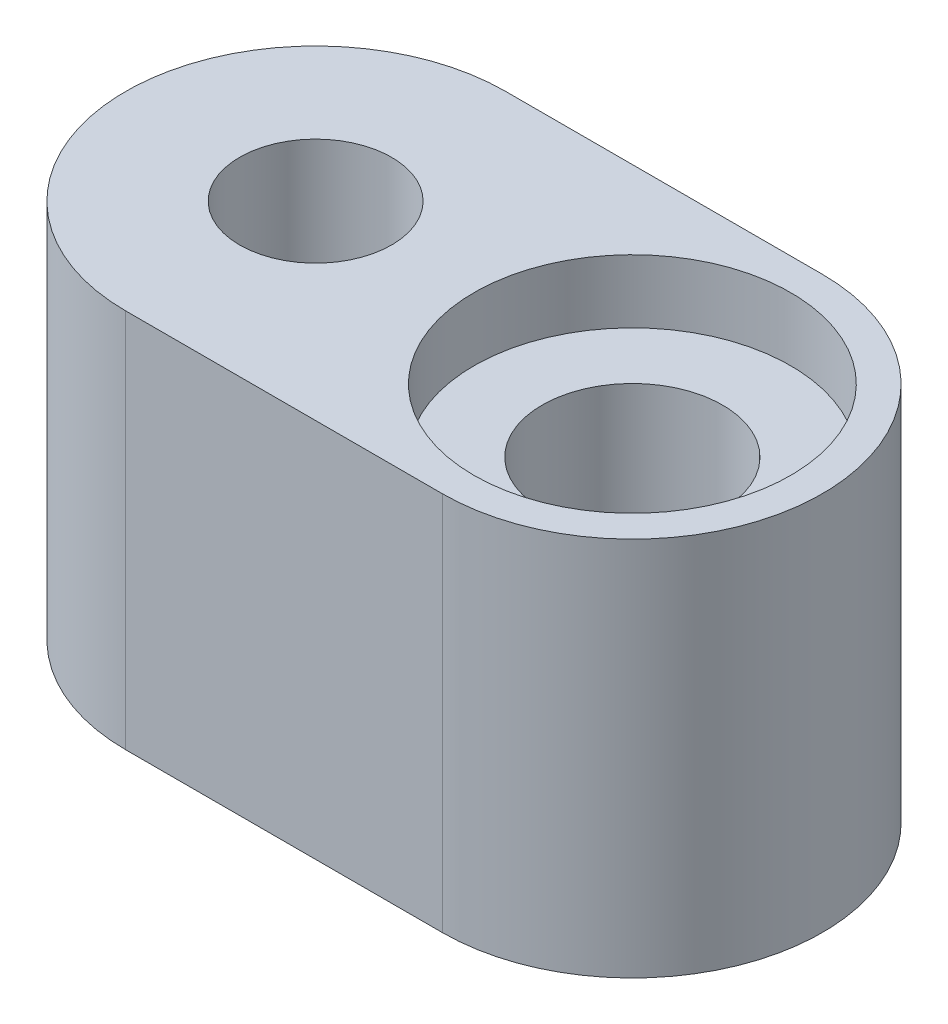
ISO-10303-21;
HEADER;
FILE_DESCRIPTION(('STEP AP214'),'2;1');
FILE_NAME('part.step','',(''),(''),'','','');
FILE_SCHEMA(('AUTOMOTIVE_DESIGN { 1 0 10303 214 1 1 1 1 }'));
ENDSEC;
DATA;
#1=APPLICATION_CONTEXT('core data for automotive mechanical design processes');
#2=APPLICATION_PROTOCOL_DEFINITION('international standard','automotive_design',2000,#1);
#3=PRODUCT_CONTEXT('',#1,'mechanical');
#4=PRODUCT('Part','Part','',(#3));
#5=PRODUCT_RELATED_PRODUCT_CATEGORY('part','',(#4));
#6=PRODUCT_DEFINITION_FORMATION('','',#4);
#7=PRODUCT_DEFINITION_CONTEXT('part definition',#1,'design');
#8=PRODUCT_DEFINITION('design','',#6,#7);
#9=PRODUCT_DEFINITION_SHAPE('','',#8);
#10=(LENGTH_UNIT() NAMED_UNIT(*) SI_UNIT(.MILLI.,.METRE.));
#11=(NAMED_UNIT(*) PLANE_ANGLE_UNIT() SI_UNIT($,.RADIAN.));
#12=(NAMED_UNIT(*) SI_UNIT($,.STERADIAN.) SOLID_ANGLE_UNIT());
#13=UNCERTAINTY_MEASURE_WITH_UNIT(LENGTH_MEASURE(1.E-05),#10,'distance_accuracy_value','');
#14=(GEOMETRIC_REPRESENTATION_CONTEXT(3) GLOBAL_UNCERTAINTY_ASSIGNED_CONTEXT((#13)) GLOBAL_UNIT_ASSIGNED_CONTEXT((#10,
#11,#12)) REPRESENTATION_CONTEXT('',''));
#15=CARTESIAN_POINT('',(0.,0.,0.));
#16=DIRECTION('',(0.,0.,1.));
#17=DIRECTION('',(1.,0.,0.));
#18=AXIS2_PLACEMENT_3D('',#15,#16,#17);
#19=CARTESIAN_POINT('',(2.5,6.,0.));
#20=DIRECTION('',(0.,-1.,0.));
#21=DIRECTION('',(0.,0.,-1.));
#22=AXIS2_PLACEMENT_3D('',#19,#20,#21);
#23=CYLINDRICAL_SURFACE('',#22,1.425);
#24=CARTESIAN_POINT('',(2.5,0.,0.));
#25=DIRECTION('',(0.,1.,0.));
#26=DIRECTION('',(0.,0.,1.));
#27=AXIS2_PLACEMENT_3D('',#24,#25,#26);
#28=CIRCLE('',#27,1.425);
#29=CARTESIAN_POINT('',(2.5,0.,1.425));
#30=VERTEX_POINT('',#29);
#31=EDGE_CURVE('E110',#30,#30,#28,.T.);
#32=ORIENTED_EDGE('',*,*,#31,.F.);
#33=EDGE_LOOP('',(#32));
#34=FACE_BOUND('',#33,.T.);
#35=CARTESIAN_POINT('',(2.5,5.,0.));
#36=DIRECTION('',(0.,1.,0.));
#37=DIRECTION('',(0.,0.,1.));
#38=AXIS2_PLACEMENT_3D('',#35,#36,#37);
#39=CIRCLE('',#38,1.425);
#40=CARTESIAN_POINT('',(2.5,5.,1.425));
#41=VERTEX_POINT('',#40);
#42=EDGE_CURVE('E44',#41,#41,#39,.T.);
#43=ORIENTED_EDGE('',*,*,#42,.T.);
#44=EDGE_LOOP('',(#43));
#45=FACE_BOUND('',#44,.T.);
#46=ADVANCED_FACE('F40',(#34,#45),#23,.F.);
#47=CARTESIAN_POINT('',(-2.5,6.,0.));
#48=DIRECTION('',(0.,1.,0.));
#49=DIRECTION('',(0.,0.,1.));
#50=AXIS2_PLACEMENT_3D('',#47,#48,#49);
#51=PLANE('',#50);
#52=CARTESIAN_POINT('',(2.5,6.,0.));
#53=DIRECTION('',(0.,1.,0.));
#54=DIRECTION('',(0.,0.,1.));
#55=AXIS2_PLACEMENT_3D('',#52,#53,#54);
#56=CIRCLE('',#55,2.5);
#57=CARTESIAN_POINT('',(2.5,6.,2.5));
#58=VERTEX_POINT('',#57);
#59=EDGE_CURVE('E130',#58,#58,#56,.T.);
#60=ORIENTED_EDGE('',*,*,#59,.F.);
#61=EDGE_LOOP('',(#60));
#62=FACE_BOUND('',#61,.T.);
#63=CARTESIAN_POINT('',(-2.5,6.,0.));
#64=DIRECTION('',(0.,1.,0.));
#65=DIRECTION('',(0.,0.,1.));
#66=AXIS2_PLACEMENT_3D('',#63,#64,#65);
#67=CIRCLE('',#66,3.);
#68=CARTESIAN_POINT('',(-2.5,6.,-3.));
#69=VERTEX_POINT('',#68);
#70=CARTESIAN_POINT('',(-2.5,6.,3.));
#71=VERTEX_POINT('',#70);
#72=EDGE_CURVE('E94',#69,#71,#67,.T.);
#73=ORIENTED_EDGE('',*,*,#72,.T.);
#74=DIRECTION('',(1.,0.,0.));
#75=VECTOR('',#74,1.);
#76=CARTESIAN_POINT('',(-2.5,6.,3.));
#77=LINE('',#76,#75);
#78=CARTESIAN_POINT('',(2.5,6.,3.));
#79=VERTEX_POINT('',#78);
#80=EDGE_CURVE('E88',#71,#79,#77,.T.);
#81=ORIENTED_EDGE('',*,*,#80,.T.);
#82=CARTESIAN_POINT('',(2.5,6.,0.));
#83=DIRECTION('',(0.,1.,0.));
#84=DIRECTION('',(0.,0.,1.));
#85=AXIS2_PLACEMENT_3D('',#82,#83,#84);
#86=CIRCLE('',#85,3.);
#87=CARTESIAN_POINT('',(2.5,6.,-3.));
#88=VERTEX_POINT('',#87);
#89=EDGE_CURVE('E92',#79,#88,#86,.T.);
#90=ORIENTED_EDGE('',*,*,#89,.T.);
#91=DIRECTION('',(-1.,0.,0.));
#92=VECTOR('',#91,1.);
#93=CARTESIAN_POINT('',(-2.5,6.,-3.));
#94=LINE('',#93,#92);
#95=EDGE_CURVE('E58',#88,#69,#94,.T.);
#96=ORIENTED_EDGE('',*,*,#95,.T.);
#97=EDGE_LOOP('',(#73,#81,#90,#96));
#98=FACE_BOUND('',#97,.T.);
#99=CARTESIAN_POINT('',(-2.5,6.,0.));
#100=DIRECTION('',(0.,1.,0.));
#101=DIRECTION('',(0.,0.,1.));
#102=AXIS2_PLACEMENT_3D('',#99,#100,#101);
#103=CIRCLE('',#102,1.2);
#104=CARTESIAN_POINT('',(-2.5,6.,1.2));
#105=VERTEX_POINT('',#104);
#106=EDGE_CURVE('E124',#105,#105,#103,.T.);
#107=ORIENTED_EDGE('',*,*,#106,.F.);
#108=EDGE_LOOP('',(#107));
#109=FACE_BOUND('',#108,.T.);
#110=ADVANCED_FACE('F89',(#62,#98,#109),#51,.T.);
#111=CARTESIAN_POINT('',(-2.5,0.,0.));
#112=DIRECTION('',(0.,1.,0.));
#113=DIRECTION('',(0.,0.,1.));
#114=AXIS2_PLACEMENT_3D('',#111,#112,#113);
#115=PLANE('',#114);
#116=CARTESIAN_POINT('',(-2.5,0.,0.));
#117=DIRECTION('',(0.,1.,0.));
#118=DIRECTION('',(0.,0.,1.));
#119=AXIS2_PLACEMENT_3D('',#116,#117,#118);
#120=CIRCLE('',#119,3.);
#121=CARTESIAN_POINT('',(-2.5,0.,-3.));
#122=VERTEX_POINT('',#121);
#123=CARTESIAN_POINT('',(-2.5,0.,3.));
#124=VERTEX_POINT('',#123);
#125=EDGE_CURVE('E107',#122,#124,#120,.T.);
#126=ORIENTED_EDGE('',*,*,#125,.F.);
#127=DIRECTION('',(-1.,0.,0.));
#128=VECTOR('',#127,1.);
#129=CARTESIAN_POINT('',(-2.5,0.,-3.));
#130=LINE('',#129,#128);
#131=CARTESIAN_POINT('',(2.5,0.,-3.));
#132=VERTEX_POINT('',#131);
#133=EDGE_CURVE('E81',#132,#122,#130,.T.);
#134=ORIENTED_EDGE('',*,*,#133,.F.);
#135=CARTESIAN_POINT('',(2.5,0.,0.));
#136=DIRECTION('',(0.,1.,0.));
#137=DIRECTION('',(0.,0.,1.));
#138=AXIS2_PLACEMENT_3D('',#135,#136,#137);
#139=CIRCLE('',#138,3.);
#140=CARTESIAN_POINT('',(2.5,0.,3.));
#141=VERTEX_POINT('',#140);
#142=EDGE_CURVE('E75',#141,#132,#139,.T.);
#143=ORIENTED_EDGE('',*,*,#142,.F.);
#144=DIRECTION('',(1.,0.,0.));
#145=VECTOR('',#144,1.);
#146=CARTESIAN_POINT('',(-2.5,0.,3.));
#147=LINE('',#146,#145);
#148=EDGE_CURVE('E98',#124,#141,#147,.T.);
#149=ORIENTED_EDGE('',*,*,#148,.F.);
#150=EDGE_LOOP('',(#126,#134,#143,#149));
#151=FACE_BOUND('',#150,.T.);
#152=ORIENTED_EDGE('',*,*,#31,.T.);
#153=EDGE_LOOP('',(#152));
#154=FACE_BOUND('',#153,.T.);
#155=CARTESIAN_POINT('',(-2.5,0.,0.));
#156=DIRECTION('',(0.,1.,0.));
#157=DIRECTION('',(0.,0.,1.));
#158=AXIS2_PLACEMENT_3D('',#155,#156,#157);
#159=CIRCLE('',#158,1.2);
#160=CARTESIAN_POINT('',(-2.5,0.,1.2));
#161=VERTEX_POINT('',#160);
#162=EDGE_CURVE('E125',#161,#161,#159,.T.);
#163=ORIENTED_EDGE('',*,*,#162,.T.);
#164=EDGE_LOOP('',(#163));
#165=FACE_BOUND('',#164,.T.);
#166=ADVANCED_FACE('F118',(#151,#154,#165),#115,.F.);
#167=CARTESIAN_POINT('',(-2.5,6.,0.));
#168=DIRECTION('',(0.,-1.,0.));
#169=DIRECTION('',(0.,0.,-1.));
#170=AXIS2_PLACEMENT_3D('',#167,#168,#169);
#171=CYLINDRICAL_SURFACE('',#170,3.);
#172=ORIENTED_EDGE('',*,*,#125,.T.);
#173=DIRECTION('',(0.,-1.,0.));
#174=VECTOR('',#173,1.);
#175=CARTESIAN_POINT('',(-2.5,6.,3.));
#176=LINE('',#175,#174);
#177=EDGE_CURVE('E11',#71,#124,#176,.T.);
#178=ORIENTED_EDGE('',*,*,#177,.F.);
#179=ORIENTED_EDGE('',*,*,#72,.F.);
#180=DIRECTION('',(0.,-1.,0.));
#181=VECTOR('',#180,1.);
#182=CARTESIAN_POINT('',(-2.5,6.,-3.));
#183=LINE('',#182,#181);
#184=EDGE_CURVE('E103',#69,#122,#183,.T.);
#185=ORIENTED_EDGE('',*,*,#184,.T.);
#186=EDGE_LOOP('',(#172,#178,#179,#185));
#187=FACE_BOUND('',#186,.T.);
#188=ADVANCED_FACE('F42',(#187),#171,.T.);
#189=CARTESIAN_POINT('',(-2.5,6.,3.));
#190=DIRECTION('',(0.,0.,-1.));
#191=DIRECTION('',(-1.,0.,0.));
#192=AXIS2_PLACEMENT_3D('',#189,#190,#191);
#193=PLANE('',#192);
#194=ORIENTED_EDGE('',*,*,#148,.T.);
#195=DIRECTION('',(0.,-1.,0.));
#196=VECTOR('',#195,1.);
#197=CARTESIAN_POINT('',(2.5,6.,3.));
#198=LINE('',#197,#196);
#199=EDGE_CURVE('E50',#79,#141,#198,.T.);
#200=ORIENTED_EDGE('',*,*,#199,.F.);
#201=ORIENTED_EDGE('',*,*,#80,.F.);
#202=ORIENTED_EDGE('',*,*,#177,.T.);
#203=EDGE_LOOP('',(#194,#200,#201,#202));
#204=FACE_BOUND('',#203,.T.);
#205=ADVANCED_FACE('F97',(#204),#193,.F.);
#206=CARTESIAN_POINT('',(2.5,6.,0.));
#207=DIRECTION('',(0.,-1.,0.));
#208=DIRECTION('',(0.,0.,-1.));
#209=AXIS2_PLACEMENT_3D('',#206,#207,#208);
#210=CYLINDRICAL_SURFACE('',#209,3.);
#211=ORIENTED_EDGE('',*,*,#142,.T.);
#212=DIRECTION('',(0.,-1.,0.));
#213=VECTOR('',#212,1.);
#214=CARTESIAN_POINT('',(2.5,6.,-3.));
#215=LINE('',#214,#213);
#216=EDGE_CURVE('E99',#88,#132,#215,.T.);
#217=ORIENTED_EDGE('',*,*,#216,.F.);
#218=ORIENTED_EDGE('',*,*,#89,.F.);
#219=ORIENTED_EDGE('',*,*,#199,.T.);
#220=EDGE_LOOP('',(#211,#217,#218,#219));
#221=FACE_BOUND('',#220,.T.);
#222=ADVANCED_FACE('F101',(#221),#210,.T.);
#223=CARTESIAN_POINT('',(-2.5,6.,-3.));
#224=DIRECTION('',(0.,0.,1.));
#225=DIRECTION('',(1.,0.,0.));
#226=AXIS2_PLACEMENT_3D('',#223,#224,#225);
#227=PLANE('',#226);
#228=ORIENTED_EDGE('',*,*,#133,.T.);
#229=ORIENTED_EDGE('',*,*,#184,.F.);
#230=ORIENTED_EDGE('',*,*,#95,.F.);
#231=ORIENTED_EDGE('',*,*,#216,.T.);
#232=EDGE_LOOP('',(#228,#229,#230,#231));
#233=FACE_BOUND('',#232,.T.);
#234=ADVANCED_FACE('F115',(#233),#227,.F.);
#235=CARTESIAN_POINT('',(-2.5,6.,0.));
#236=DIRECTION('',(0.,-1.,0.));
#237=DIRECTION('',(0.,0.,-1.));
#238=AXIS2_PLACEMENT_3D('',#235,#236,#237);
#239=CYLINDRICAL_SURFACE('',#238,1.2);
#240=ORIENTED_EDGE('',*,*,#106,.T.);
#241=EDGE_LOOP('',(#240));
#242=FACE_BOUND('',#241,.T.);
#243=ORIENTED_EDGE('',*,*,#162,.F.);
#244=EDGE_LOOP('',(#243));
#245=FACE_BOUND('',#244,.T.);
#246=ADVANCED_FACE('F148',(#242,#245),#239,.F.);
#247=CARTESIAN_POINT('',(2.5,5.,0.));
#248=DIRECTION('',(0.,1.,0.));
#249=DIRECTION('',(0.,0.,1.));
#250=AXIS2_PLACEMENT_3D('',#247,#248,#249);
#251=CYLINDRICAL_SURFACE('',#250,2.5);
#252=CARTESIAN_POINT('',(2.5,5.,0.));
#253=DIRECTION('',(0.,1.,0.));
#254=DIRECTION('',(0.,0.,1.));
#255=AXIS2_PLACEMENT_3D('',#252,#253,#254);
#256=CIRCLE('',#255,2.5);
#257=CARTESIAN_POINT('',(2.5,5.,2.5));
#258=VERTEX_POINT('',#257);
#259=EDGE_CURVE('E133',#258,#258,#256,.T.);
#260=ORIENTED_EDGE('',*,*,#259,.F.);
#261=EDGE_LOOP('',(#260));
#262=FACE_BOUND('',#261,.T.);
#263=ORIENTED_EDGE('',*,*,#59,.T.);
#264=EDGE_LOOP('',(#263));
#265=FACE_BOUND('',#264,.T.);
#266=ADVANCED_FACE('F143',(#262,#265),#251,.F.);
#267=CARTESIAN_POINT('',(2.5,5.,0.));
#268=DIRECTION('',(0.,1.,0.));
#269=DIRECTION('',(0.,0.,1.));
#270=AXIS2_PLACEMENT_3D('',#267,#268,#269);
#271=PLANE('',#270);
#272=ORIENTED_EDGE('',*,*,#42,.F.);
#273=EDGE_LOOP('',(#272));
#274=FACE_BOUND('',#273,.T.);
#275=ORIENTED_EDGE('',*,*,#259,.T.);
#276=EDGE_LOOP('',(#275));
#277=FACE_BOUND('',#276,.T.);
#278=ADVANCED_FACE('F141',(#274,#277),#271,.T.);
#279=CLOSED_SHELL('',(#46,#110,#166,#188,#205,#222,#234,#246,#266,#278));
#280=MANIFOLD_SOLID_BREP('B2',#279);
#281=ADVANCED_BREP_SHAPE_REPRESENTATION('',(#18,#280),#14);
#282=SHAPE_DEFINITION_REPRESENTATION(#9,#281);
ENDSEC;
END-ISO-10303-21;
